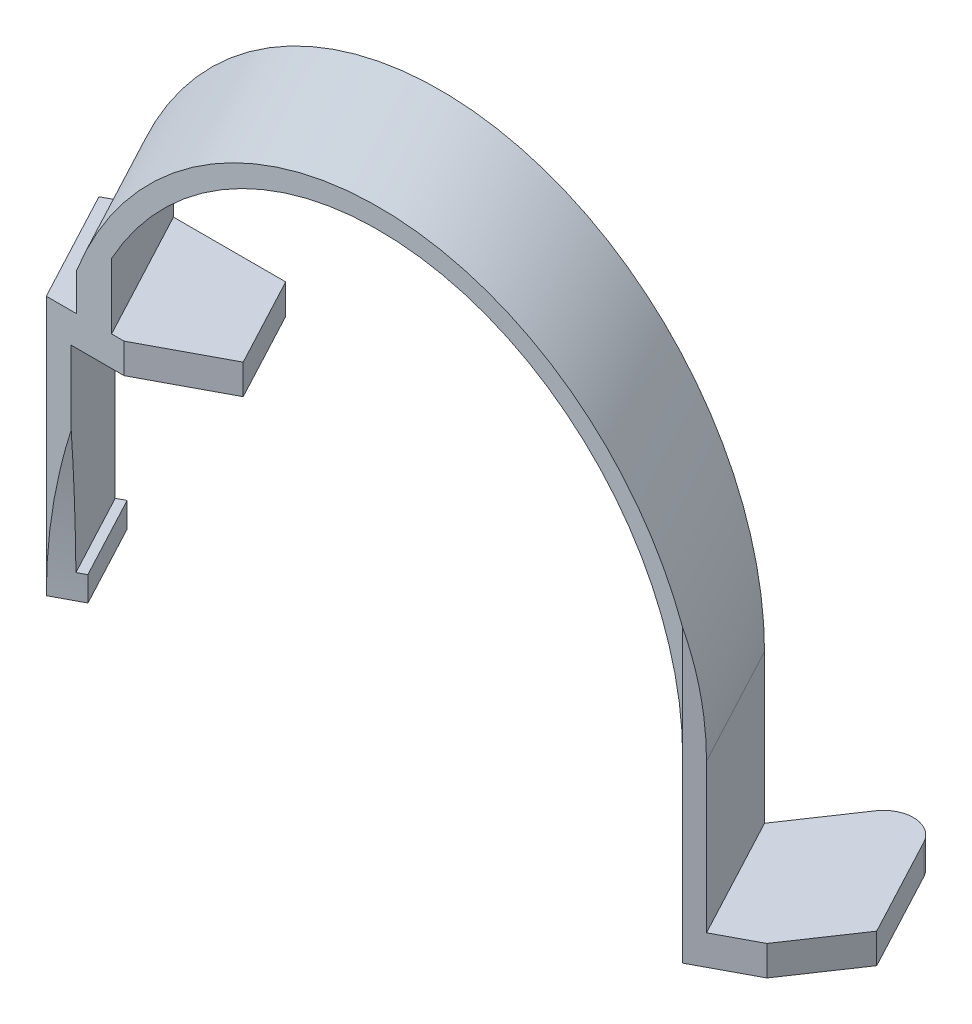
ISO-10303-21;
HEADER;
FILE_DESCRIPTION(('STEP AP214'),'2;1');
FILE_NAME('part.step','',(''),(''),'','','');
FILE_SCHEMA(('AUTOMOTIVE_DESIGN { 1 0 10303 214 1 1 1 1 }'));
ENDSEC;
DATA;
#1=APPLICATION_CONTEXT('core data for automotive mechanical design processes');
#2=APPLICATION_PROTOCOL_DEFINITION('international standard','automotive_design',2000,#1);
#3=PRODUCT_CONTEXT('',#1,'mechanical');
#4=PRODUCT('Part','Part','',(#3));
#5=PRODUCT_RELATED_PRODUCT_CATEGORY('part','',(#4));
#6=PRODUCT_DEFINITION_FORMATION('','',#4);
#7=PRODUCT_DEFINITION_CONTEXT('part definition',#1,'design');
#8=PRODUCT_DEFINITION('design','',#6,#7);
#9=PRODUCT_DEFINITION_SHAPE('','',#8);
#10=(LENGTH_UNIT() NAMED_UNIT(*) SI_UNIT(.MILLI.,.METRE.));
#11=(NAMED_UNIT(*) PLANE_ANGLE_UNIT() SI_UNIT($,.RADIAN.));
#12=(NAMED_UNIT(*) SI_UNIT($,.STERADIAN.) SOLID_ANGLE_UNIT());
#13=UNCERTAINTY_MEASURE_WITH_UNIT(LENGTH_MEASURE(1.E-05),#10,'distance_accuracy_value','');
#14=(GEOMETRIC_REPRESENTATION_CONTEXT(3) GLOBAL_UNCERTAINTY_ASSIGNED_CONTEXT((#13)) GLOBAL_UNIT_ASSIGNED_CONTEXT((#10,
#11,#12)) REPRESENTATION_CONTEXT('',''));
#15=CARTESIAN_POINT('',(0.,0.,0.));
#16=DIRECTION('',(0.,0.,1.));
#17=DIRECTION('',(1.,0.,0.));
#18=AXIS2_PLACEMENT_3D('',#15,#16,#17);
#19=CARTESIAN_POINT('',(-7.04207344178837,0.,-13.2442138928839));
#20=DIRECTION('',(0.,0.,-1.));
#21=DIRECTION('',(-1.,0.,0.));
#22=AXIS2_PLACEMENT_3D('',#19,#20,#21);
#23=PLANE('',#22);
#24=DIRECTION('',(0.,1.,0.));
#25=VECTOR('',#24,1.);
#26=CARTESIAN_POINT('',(25.4579265582116,-34.7865111003914,-13.2442138928839));
#27=LINE('',#26,#25);
#28=CARTESIAN_POINT('',(25.4579265582116,-17.9,-13.2442138928839));
#29=VERTEX_POINT('',#28);
#30=CARTESIAN_POINT('',(25.4579265582116,-14.9,-13.2442138928839));
#31=VERTEX_POINT('',#30);
#32=EDGE_CURVE('E219',#29,#31,#27,.T.);
#33=ORIENTED_EDGE('',*,*,#32,.F.);
#34=DIRECTION('',(1.,0.,0.));
#35=VECTOR('',#34,1.);
#36=CARTESIAN_POINT('',(38.4579265582116,-17.9,-13.2442138928839));
#37=LINE('',#36,#35);
#38=CARTESIAN_POINT('',(23.4579265582116,-17.9,-13.2442138928839));
#39=VERTEX_POINT('',#38);
#40=EDGE_CURVE('E347',#39,#29,#37,.T.);
#41=ORIENTED_EDGE('',*,*,#40,.F.);
#42=DIRECTION('',(0.,-1.,0.));
#43=VECTOR('',#42,1.);
#44=CARTESIAN_POINT('',(23.4579265582116,0.,-13.2442138928839));
#45=LINE('',#44,#43);
#46=CARTESIAN_POINT('',(23.4579265582116,0.,-13.2442138928839));
#47=VERTEX_POINT('',#46);
#48=EDGE_CURVE('E491',#47,#39,#45,.T.);
#49=ORIENTED_EDGE('',*,*,#48,.F.);
#50=CARTESIAN_POINT('',(-7.04207344178837,0.,-13.2442138928839));
#51=DIRECTION('',(0.,0.,-1.));
#52=DIRECTION('',(-1.,0.,0.));
#53=AXIS2_PLACEMENT_3D('',#50,#51,#52);
#54=CIRCLE('',#53,30.5);
#55=CARTESIAN_POINT('',(-33.7920734417884,14.6522182620926,-13.2442138928839));
#56=VERTEX_POINT('',#55);
#57=EDGE_CURVE('E484',#56,#47,#54,.T.);
#58=ORIENTED_EDGE('',*,*,#57,.F.);
#59=DIRECTION('',(0.,1.,0.));
#60=VECTOR('',#59,1.);
#61=CARTESIAN_POINT('',(-33.7920734417884,8.09999999999999,-13.2442138928839));
#62=LINE('',#61,#60);
#63=CARTESIAN_POINT('',(-33.7920734417884,8.09999999999999,-13.2442138928839));
#64=VERTEX_POINT('',#63);
#65=EDGE_CURVE('E476',#64,#56,#62,.T.);
#66=ORIENTED_EDGE('',*,*,#65,.F.);
#67=DIRECTION('',(-1.,0.,0.));
#68=VECTOR('',#67,1.);
#69=CARTESIAN_POINT('',(-22.5420734417884,8.1,-13.2442138928839));
#70=LINE('',#69,#68);
#71=CARTESIAN_POINT('',(-22.5420734417884,8.1,-13.2442138928839));
#72=VERTEX_POINT('',#71);
#73=EDGE_CURVE('E469',#72,#64,#70,.T.);
#74=ORIENTED_EDGE('',*,*,#73,.F.);
#75=DIRECTION('',(0.,1.,0.));
#76=VECTOR('',#75,1.);
#77=CARTESIAN_POINT('',(-22.5420734417884,5.1,-13.2442138928839));
#78=LINE('',#77,#76);
#79=CARTESIAN_POINT('',(-22.5420734417884,5.1,-13.2442138928839));
#80=VERTEX_POINT('',#79);
#81=EDGE_CURVE('E464',#80,#72,#78,.T.);
#82=ORIENTED_EDGE('',*,*,#81,.F.);
#83=DIRECTION('',(1.,0.,0.));
#84=VECTOR('',#83,1.);
#85=CARTESIAN_POINT('',(-33.7920734417884,5.1,-13.2442138928839));
#86=LINE('',#85,#84);
#87=CARTESIAN_POINT('',(-33.7920734417884,5.1,-13.2442138928839));
#88=VERTEX_POINT('',#87);
#89=EDGE_CURVE('E456',#88,#80,#86,.T.);
#90=ORIENTED_EDGE('',*,*,#89,.F.);
#91=DIRECTION('',(1.,0.,0.));
#92=VECTOR('',#91,1.);
#93=CARTESIAN_POINT('',(-37.8420734417884,5.1,-13.2442138928839));
#94=LINE('',#93,#92);
#95=CARTESIAN_POINT('',(-35.2538838395383,5.1,-13.2442138928839));
#96=VERTEX_POINT('',#95);
#97=EDGE_CURVE('E448',#96,#88,#94,.T.);
#98=ORIENTED_EDGE('',*,*,#97,.F.);
#99=CARTESIAN_POINT('',(-53.8485551832628,-2.90000000000001,-13.2442138928839));
#100=DIRECTION('',(0.,0.,-1.));
#101=DIRECTION('',(-1.,0.,0.));
#102=AXIS2_PLACEMENT_3D('',#99,#100,#101);
#103=ELLIPSE('',#102,25.2217813165167,11.8409090909091);
#104=CARTESIAN_POINT('',(-35.5880298672367,5.26788060441782,-13.2442138928839));
#105=VERTEX_POINT('',#104);
#106=EDGE_CURVE('E425',#105,#96,#103,.T.);
#107=ORIENTED_EDGE('',*,*,#106,.F.);
#108=DIRECTION('',(0.,1.,0.));
#109=VECTOR('',#108,1.);
#110=CARTESIAN_POINT('',(-35.5880298672367,0.,-13.2442138928839));
#111=LINE('',#110,#109);
#112=CARTESIAN_POINT('',(-35.5880298672367,15.5363564504811,-13.2442138928839));
#113=VERTEX_POINT('',#112);
#114=EDGE_CURVE('E258',#105,#113,#111,.T.);
#115=ORIENTED_EDGE('',*,*,#114,.T.);
#116=CARTESIAN_POINT('',(-7.04207344178837,0.,-13.2442138928839));
#117=DIRECTION('',(0.,0.,1.));
#118=DIRECTION('',(-1.,0.,0.));
#119=AXIS2_PLACEMENT_3D('',#116,#117,#118);
#120=CIRCLE('',#119,32.5);
#121=CARTESIAN_POINT('',(25.4579265582116,0.,-13.2442138928839));
#122=VERTEX_POINT('',#121);
#123=EDGE_CURVE('E229',#122,#113,#120,.T.);
#124=ORIENTED_EDGE('',*,*,#123,.F.);
#125=DIRECTION('',(0.,1.,0.));
#126=VECTOR('',#125,1.);
#127=CARTESIAN_POINT('',(25.4579265582116,-14.9,-13.2442138928839));
#128=LINE('',#127,#126);
#129=EDGE_CURVE('E224',#31,#122,#128,.T.);
#130=ORIENTED_EDGE('',*,*,#129,.F.);
#131=EDGE_LOOP('',(#33,#41,#49,#58,#66,#74,#82,#90,#98,#107,#115,#124,#130));
#132=FACE_BOUND('',#131,.T.);
#133=ADVANCED_FACE('F33',(#132),#23,.T.);
#134=CARTESIAN_POINT('',(32.5,0.,0.));
#135=CARTESIAN_POINT('',(25.4579265582116,0.,-13.2442138928839));
#136=CARTESIAN_POINT('',(32.5,46.5453658776146,0.));
#137=CARTESIAN_POINT('',(25.4579265582116,46.5453658776146,-13.2442138928839));
#138=CARTESIAN_POINT('',(-13.2326781943357,55.2052290320959,0.));
#139=CARTESIAN_POINT('',(-20.274751636124,55.2052290320959,-13.2442138928839));
#140=CARTESIAN_POINT('',(-30.25,11.8822346383162,0.));
#141=CARTESIAN_POINT('',(-37.2920734417884,11.8822346383162,-13.2442138928839));
#142=(BOUNDED_SURFACE() B_SPLINE_SURFACE(3,1,((#134,#135),(#136,#137),(#138,#139),(#140,#141)),
.UNSPECIFIED.,.F.,.F.,.F.) B_SPLINE_SURFACE_WITH_KNOTS((4,4),(2,2),(0.,1.),(0.,1.),
.UNSPECIFIED.) GEOMETRIC_REPRESENTATION_ITEM() RATIONAL_B_SPLINE_SURFACE(((1.,1.),
(0.457368067922542,0.457368067922542),(0.457368067922542,0.457368067922542),(1.,1.))) REPRESENTATION_ITEM('') SURFACE());
#143=CARTESIAN_POINT('',(-36.9164961915597,11.8822346383162,-12.5378558185968));
#144=CARTESIAN_POINT('',(-36.8687982856735,12.0379949890474,-12.5632172450269));
#145=CARTESIAN_POINT('',(-36.8201339475619,12.1933758630278,-12.5890925325864));
#146=CARTESIAN_POINT('',(-36.720905244315,12.5032509034758,-12.6418533699943));
#147=CARTESIAN_POINT('',(-36.6703420481109,12.6577455500996,-12.668738298311));
#148=CARTESIAN_POINT('',(-36.5673116330772,12.9658464892543,-12.7235205417324));
#149=CARTESIAN_POINT('',(-36.514845197407,13.1194531176933,-12.7514174404239));
#150=CARTESIAN_POINT('',(-36.4080029551091,13.4257757019607,-12.8082264683536));
#151=CARTESIAN_POINT('',(-36.3536275438921,13.5784918346865,-12.8371383873482));
#152=CARTESIAN_POINT('',(-36.242960069378,13.8830318573129,-12.8959813273255));
#153=CARTESIAN_POINT('',(-36.1866679941199,14.0348557416385,-12.925912354668));
#154=CARTESIAN_POINT('',(-36.0721595520628,14.3376059722232,-12.9867975733146));
#155=CARTESIAN_POINT('',(-36.0139428008037,14.4885321319677,-13.0177519690398));
#156=CARTESIAN_POINT('',(-35.8955755034144,14.7894821608153,-13.0806889774619));
#157=CARTESIAN_POINT('',(-35.835424181289,14.9395056384545,-13.1126720027629));
#158=CARTESIAN_POINT('',(-35.7131768580037,15.2386447351217,-13.177672057549));
#159=CARTESIAN_POINT('',(-35.6510796845373,15.3877597396114,-13.2106897103606));
#160=CARTESIAN_POINT('',(-35.5880298672367,15.5363564504811,-13.2442138928839));
#161=B_SPLINE_CURVE_WITH_KNOTS('',3,(#143,#144,#145,#146,#147,#148,#149,#150,#151,#152,#153,
#154,#155,#156,#157,#158,#159,#160),.UNSPECIFIED.,.F.,.F.,(4,2,2,2,2,2,2,2,4),(0.,
0.494583032251077,0.988866437212226,1.48294870785065,1.97692923492772,2.4709128452541,
2.96499573373384,3.45927934315677,3.95386669383938),.UNSPECIFIED.);
#162=CARTESIAN_POINT('',(-36.9164961915597,11.8822346383162,-12.5378558185968));
#163=VERTEX_POINT('',#162);
#164=EDGE_CURVE('E250',#163,#113,#161,.T.);
#165=DIRECTION('',(-0.469471562785892,0.,-0.882947592858926));
#166=VECTOR('',#165,1.);
#167=CARTESIAN_POINT('',(-30.25,11.8822346383162,0.));
#168=LINE('',#167,#166);
#169=CARTESIAN_POINT('',(-30.25,11.8822346383162,0.));
#170=VERTEX_POINT('',#169);
#171=EDGE_CURVE('E357',#170,#163,#168,.T.);
#172=CARTESIAN_POINT('',(0.,0.,0.));
#173=DIRECTION('',(0.,0.,1.));
#174=DIRECTION('',(-1.,0.,0.));
#175=AXIS2_PLACEMENT_3D('',#172,#173,#174);
#176=CIRCLE('',#175,32.5);
#177=CARTESIAN_POINT('',(30.5,11.2249721603218,0.));
#178=VERTEX_POINT('',#177);
#179=EDGE_CURVE('E352',#178,#170,#176,.T.);
#180=CARTESIAN_POINT('',(30.5,11.2249721603217,0.));
#181=CARTESIAN_POINT('',(30.5870300877948,10.9216438047626,-0.0462747185188256));
#182=CARTESIAN_POINT('',(30.6704364276544,10.6169834846295,-0.0906226560825374));
#183=CARTESIAN_POINT('',(30.8297133460518,10.0062889779655,-0.175311695840425));
#184=CARTESIAN_POINT('',(30.9056089310888,9.70026315792595,-0.215666094226057));
#185=CARTESIAN_POINT('',(31.0499792206244,9.08687043789797,-0.292429138823825));
#186=CARTESIAN_POINT('',(31.1184736321463,8.77950948571191,-0.328848263446127));
#187=CARTESIAN_POINT('',(31.2481363209366,8.16347236743959,-0.397791138010515));
#188=CARTESIAN_POINT('',(31.309319207014,7.85480014475877,-0.430322655594131));
#189=CARTESIAN_POINT('',(31.4244337380131,7.23616096360021,-0.491530137447629));
#190=CARTESIAN_POINT('',(31.4783750436956,6.92619631049452,-0.520211238435138));
#191=CARTESIAN_POINT('',(31.5790624388578,6.3049872616726,-0.573747676092342));
#192=CARTESIAN_POINT('',(31.6258133405621,5.9937438662515,-0.59860557146719));
#193=CARTESIAN_POINT('',(31.712154736267,5.37000739693937,-0.644514105906288));
#194=CARTESIAN_POINT('',(31.7517457115576,5.05751440849034,-0.66556500087697));
#195=CARTESIAN_POINT('',(31.8237919419099,4.43125077131639,-0.703872661070926));
#196=CARTESIAN_POINT('',(31.8562421367813,4.11747937601429,-0.721126735743343));
#197=CARTESIAN_POINT('',(31.914007354856,3.48865884379545,-0.751841047015646));
#198=CARTESIAN_POINT('',(31.9393124962721,3.17360854265872,-0.765296029376087));
#199=CARTESIAN_POINT('',(31.9827697650184,2.54222820401616,-0.788402669042736));
#200=CARTESIAN_POINT('',(32.0009071713295,2.22589686698319,-0.798046499044231));
#201=CARTESIAN_POINT('',(32.0299926121239,1.59195057334708,-0.813511502238647));
#202=CARTESIAN_POINT('',(32.0409210206188,1.27433446187131,-0.819322240108433));
#203=CARTESIAN_POINT('',(32.0555335570521,0.63781269376178,-0.827091863550531));
#204=CARTESIAN_POINT('',(32.0591930396647,0.318906311124735,-0.829037644970639));
#205=CARTESIAN_POINT('',(32.0591929034708,0.,-0.829037572555029));
#206=B_SPLINE_CURVE_WITH_KNOTS('',3,(#180,#181,#182,#183,#184,#185,#186,#187,#188,#189,#190,
#191,#192,#193,#194,#195,#196,#197,#198,#199,#200,#201,#202,#203,#204,#205),.UNSPECIFIED.,.F.,
.F.,(4,2,2,2,2,2,2,2,2,2,2,2,4),(0.,0.956792913563713,1.91028477245361,2.86117173935745,
3.81012584023216,4.75780111745014,5.70483937084619,6.65181394068355,7.59945742195184,
8.54840516897329,9.49929185052377,10.4527566859828,11.4094487674815),.UNSPECIFIED.);
#207=CARTESIAN_POINT('',(32.0591929034708,0.,-0.829037572555032));
#208=VERTEX_POINT('',#207);
#209=EDGE_CURVE('E296',#178,#208,#206,.T.);
#210=DIRECTION('',(-0.469471562785892,0.,-0.882947592858926));
#211=VECTOR('',#210,1.);
#212=CARTESIAN_POINT('',(32.5,0.,0.));
#213=LINE('',#212,#211);
#214=EDGE_CURVE('E232',#208,#122,#213,.T.);
#215=ORIENTED_EDGE('',*,*,#164,.F.);
#216=ORIENTED_EDGE('',*,*,#171,.F.);
#217=ORIENTED_EDGE('',*,*,#179,.F.);
#218=ORIENTED_EDGE('',*,*,#209,.T.);
#219=ORIENTED_EDGE('',*,*,#214,.T.);
#220=ORIENTED_EDGE('',*,*,#123,.T.);
#221=EDGE_LOOP('',(#215,#216,#217,#218,#219,#220));
#222=FACE_BOUND('',#221,.T.);
#223=ADVANCED_FACE('F260',(#222),#142,.F.);
#224=CARTESIAN_POINT('',(-30.25,8.09999999999999,0.));
#225=DIRECTION('',(0.882947592858927,0.,-0.469471562785892));
#226=DIRECTION('',(-0.469471562785892,0.,-0.882947592858927));
#227=AXIS2_PLACEMENT_3D('',#224,#225,#226);
#228=PLANE('',#227);
#229=DIRECTION('',(0.,1.,0.));
#230=VECTOR('',#229,1.);
#231=CARTESIAN_POINT('',(-36.9164961915597,8.09999999999999,-12.5378558185968));
#232=LINE('',#231,#230);
#233=CARTESIAN_POINT('',(-36.9164961915597,8.09999999999999,-12.5378558185967));
#234=VERTEX_POINT('',#233);
#235=EDGE_CURVE('E248',#234,#163,#232,.T.);
#236=ORIENTED_EDGE('',*,*,#235,.F.);
#237=DIRECTION('',(-0.469471562785892,0.,-0.882947592858926));
#238=VECTOR('',#237,1.);
#239=CARTESIAN_POINT('',(-30.25,8.09999999999999,0.));
#240=LINE('',#239,#238);
#241=CARTESIAN_POINT('',(-30.25,8.09999999999999,0.));
#242=VERTEX_POINT('',#241);
#243=EDGE_CURVE('E360',#242,#234,#240,.T.);
#244=ORIENTED_EDGE('',*,*,#243,.F.);
#245=DIRECTION('',(0.,-1.,0.));
#246=VECTOR('',#245,1.);
#247=CARTESIAN_POINT('',(-30.25,8.09999999999999,0.));
#248=LINE('',#247,#246);
#249=EDGE_CURVE('E354',#170,#242,#248,.T.);
#250=ORIENTED_EDGE('',*,*,#249,.F.);
#251=ORIENTED_EDGE('',*,*,#171,.T.);
#252=EDGE_LOOP('',(#236,#244,#250,#251));
#253=FACE_BOUND('',#252,.T.);
#254=ADVANCED_FACE('F565',(#253),#228,.F.);
#255=CARTESIAN_POINT('',(-33.3,8.1,0.));
#256=DIRECTION('',(0.,-1.,0.));
#257=DIRECTION('',(1.,0.,0.));
#258=AXIS2_PLACEMENT_3D('',#255,#256,#257);
#259=PLANE('',#258);
#260=DIRECTION('',(0.882947592858927,0.,-0.469471562785891));
#261=VECTOR('',#260,1.);
#262=CARTESIAN_POINT('',(-39.2942653693525,8.1,-11.2735735204503));
#263=LINE('',#262,#261);
#264=CARTESIAN_POINT('',(-39.2942653693525,8.09999999999999,-11.2735735204503));
#265=VERTEX_POINT('',#264);
#266=EDGE_CURVE('E246',#265,#234,#263,.T.);
#267=ORIENTED_EDGE('',*,*,#266,.F.);
#268=DIRECTION('',(-0.469471562785892,0.,-0.882947592858926));
#269=VECTOR('',#268,1.);
#270=CARTESIAN_POINT('',(-33.3,8.1,0.));
#271=LINE('',#270,#269);
#272=CARTESIAN_POINT('',(-33.3,8.1,0.));
#273=VERTEX_POINT('',#272);
#274=EDGE_CURVE('E366',#273,#265,#271,.T.);
#275=ORIENTED_EDGE('',*,*,#274,.F.);
#276=DIRECTION('',(-1.,0.,0.));
#277=VECTOR('',#276,1.);
#278=CARTESIAN_POINT('',(-33.3,8.1,0.));
#279=LINE('',#278,#277);
#280=EDGE_CURVE('E363',#242,#273,#279,.T.);
#281=ORIENTED_EDGE('',*,*,#280,.F.);
#282=ORIENTED_EDGE('',*,*,#243,.T.);
#283=EDGE_LOOP('',(#267,#275,#281,#282));
#284=FACE_BOUND('',#283,.T.);
#285=ADVANCED_FACE('F562',(#284),#259,.F.);
#286=CARTESIAN_POINT('',(-33.3,-17.9,0.));
#287=DIRECTION('',(0.882947592858927,0.,-0.469471562785892));
#288=DIRECTION('',(-0.469471562785892,0.,-0.882947592858927));
#289=AXIS2_PLACEMENT_3D('',#286,#287,#288);
#290=PLANE('',#289);
#291=DIRECTION('',(0.,1.,0.));
#292=VECTOR('',#291,1.);
#293=CARTESIAN_POINT('',(-39.2942653693525,-17.9,-11.2735735204503));
#294=LINE('',#293,#292);
#295=CARTESIAN_POINT('',(-39.2942653693525,5.26788060441782,-11.2735735204503));
#296=VERTEX_POINT('',#295);
#297=EDGE_CURVE('E242',#296,#265,#294,.T.);
#298=ORIENTED_EDGE('',*,*,#297,.F.);
#299=CARTESIAN_POINT('',(-43.3189499421807,-2.90000000000001,-18.8429043112394));
#300=DIRECTION('',(-0.882947592858926,0.,0.469471562785892));
#301=DIRECTION('',(0.469471562785892,0.,0.882947592858926));
#302=AXIS2_PLACEMENT_3D('',#299,#300,#301);
#303=CIRCLE('',#302,11.8409090909091);
#304=CARTESIAN_POINT('',(-37.759979846466,-2.9,-8.3880021321598));
#305=VERTEX_POINT('',#304);
#306=EDGE_CURVE('E391',#305,#296,#303,.T.);
#307=ORIENTED_EDGE('',*,*,#306,.F.);
#308=DIRECTION('',(0.,1.,0.));
#309=VECTOR('',#308,1.);
#310=CARTESIAN_POINT('',(-37.759979846466,-17.9,-8.38800213215979));
#311=LINE('',#310,#309);
#312=CARTESIAN_POINT('',(-37.759979846466,-17.9,-8.38800213215979));
#313=VERTEX_POINT('',#312);
#314=EDGE_CURVE('E396',#313,#305,#311,.T.);
#315=ORIENTED_EDGE('',*,*,#314,.F.);
#316=DIRECTION('',(-0.469471562785892,0.,-0.882947592858926));
#317=VECTOR('',#316,1.);
#318=CARTESIAN_POINT('',(-33.3,-17.9,0.));
#319=LINE('',#318,#317);
#320=CARTESIAN_POINT('',(-33.3,-17.9,0.));
#321=VERTEX_POINT('',#320);
#322=EDGE_CURVE('E372',#321,#313,#319,.T.);
#323=ORIENTED_EDGE('',*,*,#322,.F.);
#324=DIRECTION('',(0.,-1.,0.));
#325=VECTOR('',#324,1.);
#326=CARTESIAN_POINT('',(-33.3,-17.9,0.));
#327=LINE('',#326,#325);
#328=EDGE_CURVE('E369',#273,#321,#327,.T.);
#329=ORIENTED_EDGE('',*,*,#328,.F.);
#330=ORIENTED_EDGE('',*,*,#274,.T.);
#331=EDGE_LOOP('',(#298,#307,#315,#323,#329,#330));
#332=FACE_BOUND('',#331,.T.);
#333=ADVANCED_FACE('F282',(#332),#290,.F.);
#334=CARTESIAN_POINT('',(21.0258385599899,-2.90000000000001,-53.0556352361067));
#335=DIRECTION('',(-0.882947592858927,0.,0.469471562785892));
#336=DIRECTION('',(0.469471562785892,0.,0.882947592858927));
#337=AXIS2_PLACEMENT_3D('',#334,#335,#336);
#338=CYLINDRICAL_SURFACE('',#337,11.8409090909091);
#339=DIRECTION('',(-0.882947592858927,0.,0.469471562785892));
#340=VECTOR('',#339,1.);
#341=CARTESIAN_POINT('',(25.0505231328181,5.26788060441782,-45.4863044453176));
#342=LINE('',#341,#340);
#343=EDGE_CURVE('E321',#105,#296,#342,.T.);
#344=ORIENTED_EDGE('',*,*,#343,.F.);
#345=ORIENTED_EDGE('',*,*,#106,.T.);
#346=DIRECTION('',(-0.882947592858927,0.,0.469471562785892));
#347=VECTOR('',#346,1.);
#348=CARTESIAN_POINT('',(25.1241701029614,5.1,-45.3477946394766));
#349=LINE('',#348,#347);
#350=CARTESIAN_POINT('',(-37.2716272698708,5.1,-12.1713606803031));
#351=VERTEX_POINT('',#350);
#352=EDGE_CURVE('E419',#351,#96,#349,.F.);
#353=ORIENTED_EDGE('',*,*,#352,.F.);
#354=CARTESIAN_POINT('',(-41.3699588128423,-2.90000000000001,-19.8792012769332));
#355=DIRECTION('',(-0.882947592858926,0.,0.469471562785892));
#356=DIRECTION('',(0.469471562785892,0.,0.882947592858927));
#357=AXIS2_PLACEMENT_3D('',#354,#355,#356);
#358=CIRCLE('',#357,11.8409090909091);
#359=CARTESIAN_POINT('',(-35.8109887171276,-2.9,-9.4242990978536));
#360=VERTEX_POINT('',#359);
#361=EDGE_CURVE('E422',#360,#351,#358,.T.);
#362=ORIENTED_EDGE('',*,*,#361,.F.);
#363=DIRECTION('',(-0.882947592858927,0.,0.469471562785892));
#364=VECTOR('',#363,1.);
#365=CARTESIAN_POINT('',(26.5848086557047,-2.9,-42.6007330570271));
#366=LINE('',#365,#364);
#367=EDGE_CURVE('E390',#360,#305,#366,.T.);
#368=ORIENTED_EDGE('',*,*,#367,.T.);
#369=ORIENTED_EDGE('',*,*,#306,.T.);
#370=EDGE_LOOP('',(#344,#345,#353,#362,#368,#369));
#371=FACE_BOUND('',#370,.T.);
#372=ADVANCED_FACE('F278',(#371),#338,.F.);
#373=CARTESIAN_POINT('',(0.,0.,0.));
#374=DIRECTION('',(0.,0.,-1.));
#375=DIRECTION('',(-1.,0.,0.));
#376=AXIS2_PLACEMENT_3D('',#373,#374,#375);
#377=PLANE('',#376);
#378=DIRECTION('',(1.,0.,0.));
#379=VECTOR('',#378,1.);
#380=CARTESIAN_POINT('',(-26.75,5.1,0.));
#381=LINE('',#380,#379);
#382=CARTESIAN_POINT('',(-26.75,5.1,0.));
#383=VERTEX_POINT('',#382);
#384=CARTESIAN_POINT('',(-25.5000000000001,5.1,0.));
#385=VERTEX_POINT('',#384);
#386=EDGE_CURVE('E451',#383,#385,#381,.T.);
#387=ORIENTED_EDGE('',*,*,#386,.T.);
#388=DIRECTION('',(0.,1.,0.));
#389=VECTOR('',#388,1.);
#390=CARTESIAN_POINT('',(-25.5000000000001,0.,0.));
#391=LINE('',#390,#389);
#392=CARTESIAN_POINT('',(-25.5000000000001,8.09999999999999,0.));
#393=VERTEX_POINT('',#392);
#394=EDGE_CURVE('E312',#385,#393,#391,.T.);
#395=ORIENTED_EDGE('',*,*,#394,.T.);
#396=DIRECTION('',(-1.,0.,0.));
#397=VECTOR('',#396,1.);
#398=CARTESIAN_POINT('',(-15.5,8.1,0.));
#399=LINE('',#398,#397);
#400=CARTESIAN_POINT('',(-26.75,8.09999999999999,0.));
#401=VERTEX_POINT('',#400);
#402=EDGE_CURVE('E459',#393,#401,#399,.T.);
#403=ORIENTED_EDGE('',*,*,#402,.T.);
#404=DIRECTION('',(0.,1.,0.));
#405=VECTOR('',#404,1.);
#406=CARTESIAN_POINT('',(-26.75,8.09999999999999,0.));
#407=LINE('',#406,#405);
#408=CARTESIAN_POINT('',(-26.75,14.6522182620926,0.));
#409=VERTEX_POINT('',#408);
#410=EDGE_CURVE('E471',#401,#409,#407,.T.);
#411=ORIENTED_EDGE('',*,*,#410,.T.);
#412=CARTESIAN_POINT('',(0.,0.,0.));
#413=DIRECTION('',(0.,0.,-1.));
#414=DIRECTION('',(-1.,0.,0.));
#415=AXIS2_PLACEMENT_3D('',#412,#413,#414);
#416=CIRCLE('',#415,30.5);
#417=CARTESIAN_POINT('',(30.5,0.,0.));
#418=VERTEX_POINT('',#417);
#419=EDGE_CURVE('E479',#409,#418,#416,.T.);
#420=ORIENTED_EDGE('',*,*,#419,.T.);
#421=DIRECTION('',(0.,-1.,0.));
#422=VECTOR('',#421,1.);
#423=CARTESIAN_POINT('',(30.5,32.5,0.));
#424=LINE('',#423,#422);
#425=EDGE_CURVE('E430',#178,#418,#424,.T.);
#426=ORIENTED_EDGE('',*,*,#425,.F.);
#427=ORIENTED_EDGE('',*,*,#179,.T.);
#428=ORIENTED_EDGE('',*,*,#249,.T.);
#429=ORIENTED_EDGE('',*,*,#280,.T.);
#430=ORIENTED_EDGE('',*,*,#328,.T.);
#431=CARTESIAN_POINT('',(189.704479488069,-17.9,0.));
#432=DIRECTION('',(0.,0.,-1.));
#433=DIRECTION('',(-1.,0.,0.));
#434=AXIS2_PLACEMENT_3D('',#431,#432,#433);
#435=ELLIPSE('',#434,223.004479488069,104.694261493518);
#436=CARTESIAN_POINT('',(-30.8,-2.26742597606738,0.));
#437=VERTEX_POINT('',#436);
#438=EDGE_CURVE('E416',#321,#437,#435,.T.);
#439=ORIENTED_EDGE('',*,*,#438,.T.);
#440=DIRECTION('',(0.,1.,0.));
#441=VECTOR('',#440,1.);
#442=CARTESIAN_POINT('',(-30.8,-15.4161392660939,0.));
#443=LINE('',#442,#441);
#444=CARTESIAN_POINT('',(-30.8,5.1,0.));
#445=VERTEX_POINT('',#444);
#446=EDGE_CURVE('E435',#437,#445,#443,.T.);
#447=ORIENTED_EDGE('',*,*,#446,.T.);
#448=DIRECTION('',(1.,0.,0.));
#449=VECTOR('',#448,1.);
#450=CARTESIAN_POINT('',(-30.8,5.1,0.));
#451=LINE('',#450,#449);
#452=EDGE_CURVE('E445',#445,#383,#451,.T.);
#453=ORIENTED_EDGE('',*,*,#452,.T.);
#454=EDGE_LOOP('',(#387,#395,#403,#411,#420,#426,#427,#428,#429,#430,#439,#447,#453));
#455=FACE_BOUND('',#454,.T.);
#456=ADVANCED_FACE('F281',(#455),#377,.F.);
#457=CARTESIAN_POINT('',(-29.8,-17.9,0.));
#458=DIRECTION('',(-0.882947592858926,0.,0.469471562785892));
#459=DIRECTION('',(0.469471562785892,0.,0.882947592858927));
#460=AXIS2_PLACEMENT_3D('',#457,#458,#459);
#461=PLANE('',#460);
#462=DIRECTION('',(-0.469471562785892,0.,-0.882947592858926));
#463=VECTOR('',#462,1.);
#464=CARTESIAN_POINT('',(-29.8,-15.4161392660939,0.));
#465=LINE('',#464,#463);
#466=CARTESIAN_POINT('',(-30.557577646255,-15.4161392660939,-1.42479632886655));
#467=VERTEX_POINT('',#466);
#468=CARTESIAN_POINT('',(-35.0313922653922,-15.4161392660939,-9.83881788413113));
#469=VERTEX_POINT('',#468);
#470=EDGE_CURVE('E436',#467,#469,#465,.T.);
#471=ORIENTED_EDGE('',*,*,#470,.F.);
#472=CARTESIAN_POINT('',(18.5795661391506,-17.9,90.9887304198736));
#473=DIRECTION('',(-0.882947592858926,0.,0.469471562785892));
#474=DIRECTION('',(0.469471562785892,0.,0.882947592858927));
#475=AXIS2_PLACEMENT_3D('',#472,#473,#474);
#476=CIRCLE('',#475,104.694261493518);
#477=CARTESIAN_POINT('',(-30.5714124189262,-17.9,-1.45081575197132));
#478=VERTEX_POINT('',#477);
#479=EDGE_CURVE('E413',#467,#478,#476,.T.);
#480=ORIENTED_EDGE('',*,*,#479,.T.);
#481=DIRECTION('',(-0.469471562785892,0.,-0.882947592858926));
#482=VECTOR('',#481,1.);
#483=CARTESIAN_POINT('',(-29.8,-17.9,0.));
#484=LINE('',#483,#482);
#485=CARTESIAN_POINT('',(-35.0313922653922,-17.9,-9.83881788413113));
#486=VERTEX_POINT('',#485);
#487=EDGE_CURVE('E374',#478,#486,#484,.T.);
#488=ORIENTED_EDGE('',*,*,#487,.T.);
#489=DIRECTION('',(0.,1.,0.));
#490=VECTOR('',#489,1.);
#491=CARTESIAN_POINT('',(-35.0313922653922,-17.9,-9.83881788413113));
#492=LINE('',#491,#490);
#493=EDGE_CURVE('E404',#486,#469,#492,.T.);
#494=ORIENTED_EDGE('',*,*,#493,.T.);
#495=EDGE_LOOP('',(#471,#480,#488,#494));
#496=FACE_BOUND('',#495,.T.);
#497=ADVANCED_FACE('F293',(#496),#461,.F.);
#498=CARTESIAN_POINT('',(-29.8,-15.4161392660939,0.));
#499=DIRECTION('',(0.,-1.,0.));
#500=DIRECTION('',(0.,0.,-1.));
#501=AXIS2_PLACEMENT_3D('',#498,#499,#500);
#502=PLANE('',#501);
#503=DIRECTION('',(-0.469471562785892,0.,-0.882947592858926));
#504=VECTOR('',#503,1.);
#505=CARTESIAN_POINT('',(-30.8,-15.4161392660939,0.));
#506=LINE('',#505,#504);
#507=CARTESIAN_POINT('',(-31.3371740979903,-15.4161392660939,-1.01027754258902));
#508=VERTEX_POINT('',#507);
#509=CARTESIAN_POINT('',(-35.8109887171275,-15.4161392660939,-9.42429909785361));
#510=VERTEX_POINT('',#509);
#511=EDGE_CURVE('E439',#508,#510,#506,.T.);
#512=ORIENTED_EDGE('',*,*,#511,.F.);
#513=DIRECTION('',(-0.882947592858927,0.,0.469471562785892));
#514=VECTOR('',#513,1.);
#515=CARTESIAN_POINT('',(31.0586232748419,-15.4161392660939,-34.1867115017625));
#516=LINE('',#515,#514);
#517=EDGE_CURVE('E410',#508,#467,#516,.F.);
#518=ORIENTED_EDGE('',*,*,#517,.T.);
#519=ORIENTED_EDGE('',*,*,#470,.T.);
#520=DIRECTION('',(-0.882947592858927,0.,0.469471562785892));
#521=VECTOR('',#520,1.);
#522=CARTESIAN_POINT('',(-35.0313922653922,-15.4161392660939,-9.83881788413113));
#523=LINE('',#522,#521);
#524=EDGE_CURVE('E401',#469,#510,#523,.T.);
#525=ORIENTED_EDGE('',*,*,#524,.T.);
#526=EDGE_LOOP('',(#512,#518,#519,#525));
#527=FACE_BOUND('',#526,.T.);
#528=ADVANCED_FACE('F542',(#527),#502,.F.);
#529=CARTESIAN_POINT('',(-30.8,-15.4161392660939,0.));
#530=DIRECTION('',(-0.882947592858926,0.,0.469471562785892));
#531=DIRECTION('',(0.469471562785892,0.,0.882947592858927));
#532=AXIS2_PLACEMENT_3D('',#529,#530,#531);
#533=PLANE('',#532);
#534=ORIENTED_EDGE('',*,*,#446,.F.);
#535=CARTESIAN_POINT('',(17.7999696874152,-17.9,91.4032492061511));
#536=DIRECTION('',(-0.882947592858926,0.,0.469471562785892));
#537=DIRECTION('',(0.469471562785892,0.,0.882947592858927));
#538=AXIS2_PLACEMENT_3D('',#535,#536,#537);
#539=CIRCLE('',#538,104.694261493518);
#540=EDGE_CURVE('E407',#437,#508,#539,.T.);
#541=ORIENTED_EDGE('',*,*,#540,.T.);
#542=ORIENTED_EDGE('',*,*,#511,.T.);
#543=DIRECTION('',(0.,1.,0.));
#544=VECTOR('',#543,1.);
#545=CARTESIAN_POINT('',(-35.8109887171275,-15.4161392660939,-9.42429909785361));
#546=LINE('',#545,#544);
#547=EDGE_CURVE('E393',#510,#360,#546,.T.);
#548=ORIENTED_EDGE('',*,*,#547,.T.);
#549=ORIENTED_EDGE('',*,*,#361,.T.);
#550=DIRECTION('',(-0.469471562785892,0.,-0.882947592858926));
#551=VECTOR('',#550,1.);
#552=CARTESIAN_POINT('',(-30.8,5.1,0.));
#553=LINE('',#552,#551);
#554=EDGE_CURVE('E443',#445,#351,#553,.T.);
#555=ORIENTED_EDGE('',*,*,#554,.F.);
#556=EDGE_LOOP('',(#534,#541,#542,#548,#549,#555));
#557=FACE_BOUND('',#556,.T.);
#558=ADVANCED_FACE('F539',(#557),#533,.F.);
#559=CARTESIAN_POINT('',(-30.8,5.1,0.));
#560=DIRECTION('',(0.,1.,0.));
#561=DIRECTION('',(0.,0.,1.));
#562=AXIS2_PLACEMENT_3D('',#559,#560,#561);
#563=PLANE('',#562);
#564=ORIENTED_EDGE('',*,*,#554,.T.);
#565=ORIENTED_EDGE('',*,*,#352,.T.);
#566=ORIENTED_EDGE('',*,*,#97,.T.);
#567=DIRECTION('',(-0.469471562785892,0.,-0.882947592858926));
#568=VECTOR('',#567,1.);
#569=CARTESIAN_POINT('',(-26.75,5.1,0.));
#570=LINE('',#569,#568);
#571=EDGE_CURVE('E453',#383,#88,#570,.T.);
#572=ORIENTED_EDGE('',*,*,#571,.F.);
#573=ORIENTED_EDGE('',*,*,#452,.F.);
#574=EDGE_LOOP('',(#564,#565,#566,#572,#573));
#575=FACE_BOUND('',#574,.T.);
#576=ADVANCED_FACE('F532',(#575),#563,.F.);
#577=CARTESIAN_POINT('',(-26.75,5.1,0.));
#578=DIRECTION('',(0.,1.,0.));
#579=DIRECTION('',(0.,0.,1.));
#580=AXIS2_PLACEMENT_3D('',#577,#578,#579);
#581=PLANE('',#580);
#582=DIRECTION('',(-0.469471562785892,0.,-0.882947592858926));
#583=VECTOR('',#582,1.);
#584=CARTESIAN_POINT('',(-15.5,5.1,0.));
#585=LINE('',#584,#583);
#586=CARTESIAN_POINT('',(-17.7040354826463,5.1,-4.14518786277525));
#587=VERTEX_POINT('',#586);
#588=EDGE_CURVE('E462',#587,#80,#585,.T.);
#589=ORIENTED_EDGE('',*,*,#588,.F.);
#590=DIRECTION('',(0.882947592858926,0.,-0.469471562785893));
#591=VECTOR('',#590,1.);
#592=CARTESIAN_POINT('',(-25.5000000000001,5.1,0.));
#593=LINE('',#592,#591);
#594=EDGE_CURVE('E319',#587,#385,#593,.F.);
#595=ORIENTED_EDGE('',*,*,#594,.T.);
#596=ORIENTED_EDGE('',*,*,#386,.F.);
#597=ORIENTED_EDGE('',*,*,#571,.T.);
#598=ORIENTED_EDGE('',*,*,#89,.T.);
#599=EDGE_LOOP('',(#589,#595,#596,#597,#598));
#600=FACE_BOUND('',#599,.T.);
#601=ADVANCED_FACE('F527',(#600),#581,.F.);
#602=CARTESIAN_POINT('',(-15.5,5.1,0.));
#603=DIRECTION('',(-0.882947592858926,0.,0.469471562785892));
#604=DIRECTION('',(0.469471562785892,0.,0.882947592858927));
#605=AXIS2_PLACEMENT_3D('',#602,#603,#604);
#606=PLANE('',#605);
#607=DIRECTION('',(-0.469471562785892,0.,-0.882947592858926));
#608=VECTOR('',#607,1.);
#609=CARTESIAN_POINT('',(-15.5,8.1,0.));
#610=LINE('',#609,#608);
#611=CARTESIAN_POINT('',(-17.7040354826463,8.1,-4.14518786277525));
#612=VERTEX_POINT('',#611);
#613=EDGE_CURVE('E467',#612,#72,#610,.T.);
#614=ORIENTED_EDGE('',*,*,#613,.F.);
#615=DIRECTION('',(0.,-1.,0.));
#616=VECTOR('',#615,1.);
#617=CARTESIAN_POINT('',(-17.7040354826463,5.1,-4.14518786277525));
#618=LINE('',#617,#616);
#619=EDGE_CURVE('E317',#612,#587,#618,.T.);
#620=ORIENTED_EDGE('',*,*,#619,.T.);
#621=ORIENTED_EDGE('',*,*,#588,.T.);
#622=ORIENTED_EDGE('',*,*,#81,.T.);
#623=EDGE_LOOP('',(#614,#620,#621,#622));
#624=FACE_BOUND('',#623,.T.);
#625=ADVANCED_FACE('F523',(#624),#606,.F.);
#626=CARTESIAN_POINT('',(-15.5,8.1,0.));
#627=DIRECTION('',(0.,-1.,0.));
#628=DIRECTION('',(1.,0.,0.));
#629=AXIS2_PLACEMENT_3D('',#626,#627,#628);
#630=PLANE('',#629);
#631=ORIENTED_EDGE('',*,*,#402,.F.);
#632=DIRECTION('',(-0.882947592858926,0.,0.469471562785893));
#633=VECTOR('',#632,1.);
#634=CARTESIAN_POINT('',(-25.5000000000001,8.09999999999999,0.));
#635=LINE('',#634,#633);
#636=EDGE_CURVE('E315',#393,#612,#635,.F.);
#637=ORIENTED_EDGE('',*,*,#636,.T.);
#638=ORIENTED_EDGE('',*,*,#613,.T.);
#639=ORIENTED_EDGE('',*,*,#73,.T.);
#640=DIRECTION('',(-0.469471562785892,0.,-0.882947592858926));
#641=VECTOR('',#640,1.);
#642=CARTESIAN_POINT('',(-26.75,8.09999999999999,0.));
#643=LINE('',#642,#641);
#644=EDGE_CURVE('E473',#401,#64,#643,.T.);
#645=ORIENTED_EDGE('',*,*,#644,.F.);
#646=EDGE_LOOP('',(#631,#637,#638,#639,#645));
#647=FACE_BOUND('',#646,.T.);
#648=ADVANCED_FACE('F519',(#647),#630,.F.);
#649=CARTESIAN_POINT('',(-26.75,8.09999999999999,0.));
#650=DIRECTION('',(-0.882947592858926,0.,0.469471562785892));
#651=DIRECTION('',(0.469471562785892,0.,0.882947592858927));
#652=AXIS2_PLACEMENT_3D('',#649,#650,#651);
#653=PLANE('',#652);
#654=DIRECTION('',(-0.469471562785892,0.,-0.882947592858926));
#655=VECTOR('',#654,1.);
#656=CARTESIAN_POINT('',(-26.75,14.6522182620926,0.));
#657=LINE('',#656,#655);
#658=EDGE_CURVE('E481',#409,#56,#657,.T.);
#659=ORIENTED_EDGE('',*,*,#658,.F.);
#660=ORIENTED_EDGE('',*,*,#410,.F.);
#661=ORIENTED_EDGE('',*,*,#644,.T.);
#662=ORIENTED_EDGE('',*,*,#65,.T.);
#663=EDGE_LOOP('',(#659,#660,#661,#662));
#664=FACE_BOUND('',#663,.T.);
#665=ADVANCED_FACE('F512',(#664),#653,.F.);
#666=CARTESIAN_POINT('',(-26.75,14.6522182620926,0.));
#667=CARTESIAN_POINT('',(-33.7920734417884,14.6522182620926,-13.2442138928839));
#668=CARTESIAN_POINT('',(-7.77166616460646,49.3002436337999,0.));
#669=CARTESIAN_POINT('',(-14.8137396063948,49.3002436337999,-13.2442138928839));
#670=CARTESIAN_POINT('',(30.5,39.5052251901709,0.));
#671=CARTESIAN_POINT('',(23.4579265582116,39.5052251901709,-13.2442138928839));
#672=CARTESIAN_POINT('',(30.5,0.,0.));
#673=CARTESIAN_POINT('',(23.4579265582116,0.,-13.2442138928839));
#674=(BOUNDED_SURFACE() B_SPLINE_SURFACE(3,1,((#666,#667),(#668,#669),(#670,#671),(#672,#673)),
.UNSPECIFIED.,.F.,.F.,.F.) B_SPLINE_SURFACE_WITH_KNOTS((4,4),(2,2),(0.,1.),(0.,1.),
.UNSPECIFIED.) GEOMETRIC_REPRESENTATION_ITEM() RATIONAL_B_SPLINE_SURFACE(((1.,1.),
(0.498628234560155,0.498628234560155),(0.498628234560155,0.498628234560155),(1.,1.))) REPRESENTATION_ITEM('') SURFACE());
#675=DIRECTION('',(-0.469471562785892,0.,-0.882947592858926));
#676=VECTOR('',#675,1.);
#677=CARTESIAN_POINT('',(30.5,0.,0.));
#678=LINE('',#677,#676);
#679=EDGE_CURVE('E488',#418,#47,#678,.T.);
#680=ORIENTED_EDGE('',*,*,#679,.F.);
#681=ORIENTED_EDGE('',*,*,#419,.F.);
#682=ORIENTED_EDGE('',*,*,#658,.T.);
#683=ORIENTED_EDGE('',*,*,#57,.T.);
#684=EDGE_LOOP('',(#680,#681,#682,#683));
#685=FACE_BOUND('',#684,.T.);
#686=ADVANCED_FACE('F508',(#685),#674,.F.);
#687=CARTESIAN_POINT('',(30.5,0.,0.));
#688=DIRECTION('',(0.882947592858926,0.,-0.469471562785892));
#689=DIRECTION('',(-0.469471562785892,0.,-0.882947592858927));
#690=AXIS2_PLACEMENT_3D('',#687,#688,#689);
#691=PLANE('',#690);
#692=DIRECTION('',(-0.469471562785892,0.,-0.882947592858926));
#693=VECTOR('',#692,1.);
#694=CARTESIAN_POINT('',(30.5,-17.9,0.));
#695=LINE('',#694,#693);
#696=CARTESIAN_POINT('',(30.5,-17.9,0.));
#697=VERTEX_POINT('',#696);
#698=EDGE_CURVE('E494',#697,#39,#695,.T.);
#699=ORIENTED_EDGE('',*,*,#698,.F.);
#700=DIRECTION('',(0.,-1.,0.));
#701=VECTOR('',#700,1.);
#702=CARTESIAN_POINT('',(30.5,0.,0.));
#703=LINE('',#702,#701);
#704=EDGE_CURVE('E355',#418,#697,#703,.T.);
#705=ORIENTED_EDGE('',*,*,#704,.F.);
#706=ORIENTED_EDGE('',*,*,#679,.T.);
#707=ORIENTED_EDGE('',*,*,#48,.T.);
#708=EDGE_LOOP('',(#699,#705,#706,#707));
#709=FACE_BOUND('',#708,.T.);
#710=ADVANCED_FACE('F506',(#709),#691,.F.);
#711=CARTESIAN_POINT('',(45.5,-17.9,0.));
#712=DIRECTION('',(0.,1.,0.));
#713=DIRECTION('',(0.,0.,1.));
#714=AXIS2_PLACEMENT_3D('',#711,#712,#713);
#715=PLANE('',#714);
#716=DIRECTION('',(0.559192903470751,0.,-0.829037572555039));
#717=VECTOR('',#716,1.);
#718=CARTESIAN_POINT('',(25.4579265582116,-17.9,-13.2442138928839));
#719=LINE('',#718,#717);
#720=CARTESIAN_POINT('',(29.9354744755642,-17.9,-19.8824516697963));
#721=VERTEX_POINT('',#720);
#722=EDGE_CURVE('E240',#29,#721,#719,.T.);
#723=ORIENTED_EDGE('',*,*,#722,.T.);
#724=CARTESIAN_POINT('',(32.4225871932293,-17.9,-18.2048729593841));
#725=DIRECTION('',(0.,1.,0.));
#726=DIRECTION('',(0.,0.,1.));
#727=AXIS2_PLACEMENT_3D('',#724,#725,#726);
#728=CIRCLE('',#727,3.);
#729=CARTESIAN_POINT('',(35.0714299718061,-17.9,-19.6132876477417));
#730=VERTEX_POINT('',#729);
#731=EDGE_CURVE('E11',#721,#730,#728,.F.);
#732=ORIENTED_EDGE('',*,*,#731,.T.);
#733=DIRECTION('',(-0.469471562785892,0.,-0.882947592858926));
#734=VECTOR('',#733,1.);
#735=CARTESIAN_POINT('',(45.5,-17.9,0.));
#736=LINE('',#735,#734);
#737=CARTESIAN_POINT('',(40.4465895712198,-17.9,-9.50408273366398));
#738=VERTEX_POINT('',#737);
#739=EDGE_CURVE('E342',#738,#730,#736,.T.);
#740=ORIENTED_EDGE('',*,*,#739,.F.);
#741=DIRECTION('',(0.559192903470754,0.,-0.829037572555037));
#742=VECTOR('',#741,1.);
#743=CARTESIAN_POINT('',(40.4465895712198,-17.9,-9.50408273366398));
#744=LINE('',#743,#742);
#745=CARTESIAN_POINT('',(36.0133136260181,-17.9,-2.9314808546615));
#746=VERTEX_POINT('',#745);
#747=EDGE_CURVE('E326',#738,#746,#744,.F.);
#748=ORIENTED_EDGE('',*,*,#747,.T.);
#749=DIRECTION('',(0.88294759285893,0.,-0.469471562785886));
#750=VECTOR('',#749,1.);
#751=CARTESIAN_POINT('',(42.1939467760306,-17.9,-6.21778179416273));
#752=LINE('',#751,#750);
#753=EDGE_CURVE('E427',#697,#746,#752,.T.);
#754=ORIENTED_EDGE('',*,*,#753,.F.);
#755=ORIENTED_EDGE('',*,*,#698,.T.);
#756=ORIENTED_EDGE('',*,*,#40,.T.);
#757=EDGE_LOOP('',(#723,#732,#740,#748,#754,#755,#756));
#758=FACE_BOUND('',#757,.T.);
#759=ADVANCED_FACE('F497',(#758),#715,.F.);
#760=CARTESIAN_POINT('',(45.5,-14.9,0.));
#761=DIRECTION('',(-0.882947592858926,0.,0.469471562785892));
#762=DIRECTION('',(0.469471562785892,0.,0.882947592858927));
#763=AXIS2_PLACEMENT_3D('',#760,#761,#762);
#764=PLANE('',#763);
#765=ORIENTED_EDGE('',*,*,#739,.T.);
#766=DIRECTION('',(0.,1.,0.));
#767=VECTOR('',#766,1.);
#768=CARTESIAN_POINT('',(35.0714299718061,-14.9,-19.6132876477417));
#769=LINE('',#768,#767);
#770=CARTESIAN_POINT('',(35.0714299718061,-14.9,-19.6132876477417));
#771=VERTEX_POINT('',#770);
#772=EDGE_CURVE('E332',#730,#771,#769,.T.);
#773=ORIENTED_EDGE('',*,*,#772,.T.);
#774=DIRECTION('',(-0.469471562785892,0.,-0.882947592858926));
#775=VECTOR('',#774,1.);
#776=CARTESIAN_POINT('',(45.5,-14.9,0.));
#777=LINE('',#776,#775);
#778=CARTESIAN_POINT('',(40.4465895712198,-14.9,-9.50408273366398));
#779=VERTEX_POINT('',#778);
#780=EDGE_CURVE('E237',#779,#771,#777,.T.);
#781=ORIENTED_EDGE('',*,*,#780,.F.);
#782=DIRECTION('',(0.,-1.,0.));
#783=VECTOR('',#782,1.);
#784=CARTESIAN_POINT('',(40.4465895712198,-14.9,-9.50408273366398));
#785=LINE('',#784,#783);
#786=EDGE_CURVE('E323',#779,#738,#785,.T.);
#787=ORIENTED_EDGE('',*,*,#786,.T.);
#788=EDGE_LOOP('',(#765,#773,#781,#787));
#789=FACE_BOUND('',#788,.T.);
#790=ADVANCED_FACE('F339',(#789),#764,.F.);
#791=CARTESIAN_POINT('',(32.5,-14.9,0.));
#792=DIRECTION('',(0.,-1.,0.));
#793=DIRECTION('',(0.,0.,-1.));
#794=AXIS2_PLACEMENT_3D('',#791,#792,#793);
#795=PLANE('',#794);
#796=ORIENTED_EDGE('',*,*,#780,.T.);
#797=CARTESIAN_POINT('',(32.4225871932293,-14.9,-18.2048729593841));
#798=DIRECTION('',(0.,-1.,0.));
#799=DIRECTION('',(0.,0.,-1.));
#800=AXIS2_PLACEMENT_3D('',#797,#798,#799);
#801=CIRCLE('',#800,3.);
#802=CARTESIAN_POINT('',(29.9354744755642,-14.9,-19.8824516697963));
#803=VERTEX_POINT('',#802);
#804=EDGE_CURVE('E55',#771,#803,#801,.F.);
#805=ORIENTED_EDGE('',*,*,#804,.T.);
#806=DIRECTION('',(-0.559192903470751,0.,0.829037572555039));
#807=VECTOR('',#806,1.);
#808=CARTESIAN_POINT('',(25.4579265582116,-14.9,-13.2442138928839));
#809=LINE('',#808,#807);
#810=EDGE_CURVE('E212',#803,#31,#809,.T.);
#811=ORIENTED_EDGE('',*,*,#810,.T.);
#812=DIRECTION('',(-0.469471562785892,0.,-0.882947592858926));
#813=VECTOR('',#812,1.);
#814=CARTESIAN_POINT('',(32.5,-14.9,0.));
#815=LINE('',#814,#813);
#816=CARTESIAN_POINT('',(32.0591929034708,-14.9,-0.829037572555032));
#817=VERTEX_POINT('',#816);
#818=EDGE_CURVE('E217',#817,#31,#815,.T.);
#819=ORIENTED_EDGE('',*,*,#818,.F.);
#820=DIRECTION('',(0.88294759285893,0.,-0.469471562785886));
#821=VECTOR('',#820,1.);
#822=CARTESIAN_POINT('',(32.0591929034708,-14.9,-0.829037572555035));
#823=LINE('',#822,#821);
#824=CARTESIAN_POINT('',(36.0133136260181,-14.9,-2.9314808546615));
#825=VERTEX_POINT('',#824);
#826=EDGE_CURVE('E433',#817,#825,#823,.T.);
#827=ORIENTED_EDGE('',*,*,#826,.T.);
#828=DIRECTION('',(-0.559192903470754,0.,0.829037572555037));
#829=VECTOR('',#828,1.);
#830=CARTESIAN_POINT('',(40.4465895712198,-14.9,-9.50408273366398));
#831=LINE('',#830,#829);
#832=EDGE_CURVE('E330',#825,#779,#831,.F.);
#833=ORIENTED_EDGE('',*,*,#832,.T.);
#834=EDGE_LOOP('',(#796,#805,#811,#819,#827,#833));
#835=FACE_BOUND('',#834,.T.);
#836=ADVANCED_FACE('F214',(#835),#795,.F.);
#837=CARTESIAN_POINT('',(32.5,-14.9,0.));
#838=DIRECTION('',(-0.882947592858926,0.,0.469471562785892));
#839=DIRECTION('',(0.469471562785892,0.,0.882947592858927));
#840=AXIS2_PLACEMENT_3D('',#837,#838,#839);
#841=PLANE('',#840);
#842=ORIENTED_EDGE('',*,*,#214,.F.);
#843=DIRECTION('',(0.,-1.,0.));
#844=VECTOR('',#843,1.);
#845=CARTESIAN_POINT('',(32.0591929034708,-14.9,-0.829037572555032));
#846=LINE('',#845,#844);
#847=EDGE_CURVE('E236',#208,#817,#846,.T.);
#848=ORIENTED_EDGE('',*,*,#847,.T.);
#849=ORIENTED_EDGE('',*,*,#818,.T.);
#850=ORIENTED_EDGE('',*,*,#129,.T.);
#851=EDGE_LOOP('',(#842,#848,#849,#850));
#852=FACE_BOUND('',#851,.T.);
#853=ADVANCED_FACE('F235',(#852),#841,.F.);
#854=CARTESIAN_POINT('',(-33.3,-17.9,0.));
#855=DIRECTION('',(0.,1.,0.));
#856=DIRECTION('',(0.,0.,1.));
#857=AXIS2_PLACEMENT_3D('',#854,#855,#856);
#858=PLANE('',#857);
#859=DIRECTION('',(-0.469471562785892,0.,-0.882947592858926));
#860=VECTOR('',#859,1.);
#861=CARTESIAN_POINT('',(-30.8,-17.9,0.));
#862=LINE('',#861,#860);
#863=CARTESIAN_POINT('',(-31.3510088706616,-17.9,-1.03629696569381));
#864=VERTEX_POINT('',#863);
#865=CARTESIAN_POINT('',(-35.8109887171276,-17.9,-9.4242990978536));
#866=VERTEX_POINT('',#865);
#867=EDGE_CURVE('E305',#864,#866,#862,.T.);
#868=ORIENTED_EDGE('',*,*,#867,.F.);
#869=DIRECTION('',(-0.882947592858927,0.,0.469471562785892));
#870=VECTOR('',#869,1.);
#871=CARTESIAN_POINT('',(31.0447885021707,-17.9,-34.2127309248673));
#872=LINE('',#871,#870);
#873=EDGE_CURVE('E386',#864,#321,#872,.T.);
#874=ORIENTED_EDGE('',*,*,#873,.T.);
#875=ORIENTED_EDGE('',*,*,#322,.T.);
#876=DIRECTION('',(-0.882947592858927,0.,0.469471562785892));
#877=VECTOR('',#876,1.);
#878=CARTESIAN_POINT('',(26.5848086557047,-17.9,-42.6007330570271));
#879=LINE('',#878,#877);
#880=EDGE_CURVE('E387',#866,#313,#879,.T.);
#881=ORIENTED_EDGE('',*,*,#880,.F.);
#882=EDGE_LOOP('',(#868,#874,#875,#881));
#883=FACE_BOUND('',#882,.T.);
#884=ADVANCED_FACE('F385',(#883),#858,.F.);
#885=CARTESIAN_POINT('',(-30.8,-17.9,0.));
#886=DIRECTION('',(0.,1.,0.));
#887=DIRECTION('',(0.,0.,1.));
#888=AXIS2_PLACEMENT_3D('',#885,#886,#887);
#889=PLANE('',#888);
#890=ORIENTED_EDGE('',*,*,#487,.F.);
#891=DIRECTION('',(-0.882947592858927,0.,0.469471562785892));
#892=VECTOR('',#891,1.);
#893=CARTESIAN_POINT('',(31.0447885021707,-17.9,-34.2127309248673));
#894=LINE('',#893,#892);
#895=EDGE_CURVE('E309',#478,#864,#894,.T.);
#896=ORIENTED_EDGE('',*,*,#895,.T.);
#897=ORIENTED_EDGE('',*,*,#867,.T.);
#898=DIRECTION('',(0.882947592858927,0.,-0.469471562785892));
#899=VECTOR('',#898,1.);
#900=CARTESIAN_POINT('',(-35.8109887171275,-17.9,-9.42429909785361));
#901=LINE('',#900,#899);
#902=EDGE_CURVE('E304',#866,#486,#901,.T.);
#903=ORIENTED_EDGE('',*,*,#902,.T.);
#904=EDGE_LOOP('',(#890,#896,#897,#903));
#905=FACE_BOUND('',#904,.T.);
#906=ADVANCED_FACE('F284',(#905),#889,.F.);
#907=CARTESIAN_POINT('',(42.1939467760306,32.5000000000001,-6.21778179416271));
#908=DIRECTION('',(-0.469471562785886,0.,-0.88294759285893));
#909=DIRECTION('',(-0.88294759285893,0.,0.469471562785886));
#910=AXIS2_PLACEMENT_3D('',#907,#908,#909);
#911=PLANE('',#910);
#912=ORIENTED_EDGE('',*,*,#753,.T.);
#913=DIRECTION('',(0.,1.,0.));
#914=VECTOR('',#913,1.);
#915=CARTESIAN_POINT('',(36.0133136260181,32.5000000000001,-2.9314808546615));
#916=LINE('',#915,#914);
#917=EDGE_CURVE('E328',#746,#825,#916,.T.);
#918=ORIENTED_EDGE('',*,*,#917,.T.);
#919=ORIENTED_EDGE('',*,*,#826,.F.);
#920=ORIENTED_EDGE('',*,*,#847,.F.);
#921=ORIENTED_EDGE('',*,*,#209,.F.);
#922=ORIENTED_EDGE('',*,*,#425,.T.);
#923=ORIENTED_EDGE('',*,*,#704,.T.);
#924=EDGE_LOOP('',(#912,#918,#919,#920,#921,#922,#923));
#925=FACE_BOUND('',#924,.T.);
#926=ADVANCED_FACE('F287',(#925),#911,.F.);
#927=CARTESIAN_POINT('',(26.5848086557047,-17.9,-42.6007330570271));
#928=DIRECTION('',(0.469471562785892,0.,0.882947592858927));
#929=DIRECTION('',(0.882947592858927,0.,-0.469471562785892));
#930=AXIS2_PLACEMENT_3D('',#927,#928,#929);
#931=PLANE('',#930);
#932=ORIENTED_EDGE('',*,*,#902,.F.);
#933=ORIENTED_EDGE('',*,*,#880,.T.);
#934=ORIENTED_EDGE('',*,*,#314,.T.);
#935=ORIENTED_EDGE('',*,*,#367,.F.);
#936=ORIENTED_EDGE('',*,*,#547,.F.);
#937=ORIENTED_EDGE('',*,*,#524,.F.);
#938=ORIENTED_EDGE('',*,*,#493,.F.);
#939=EDGE_LOOP('',(#932,#933,#934,#935,#936,#937,#938));
#940=FACE_BOUND('',#939,.T.);
#941=ADVANCED_FACE('F276',(#940),#931,.F.);
#942=CARTESIAN_POINT('',(80.1957670602475,-17.9,58.2268152469776));
#943=DIRECTION('',(-0.882947592858927,0.,0.469471562785892));
#944=DIRECTION('',(0.469471562785892,0.,0.882947592858927));
#945=AXIS2_PLACEMENT_3D('',#942,#943,#944);
#946=CYLINDRICAL_SURFACE('',#945,104.694261493518);
#947=ORIENTED_EDGE('',*,*,#873,.F.);
#948=ORIENTED_EDGE('',*,*,#895,.F.);
#949=ORIENTED_EDGE('',*,*,#479,.F.);
#950=ORIENTED_EDGE('',*,*,#517,.F.);
#951=ORIENTED_EDGE('',*,*,#540,.F.);
#952=ORIENTED_EDGE('',*,*,#438,.F.);
#953=EDGE_LOOP('',(#947,#948,#949,#950,#951,#952));
#954=FACE_BOUND('',#953,.T.);
#955=ADVANCED_FACE('F273',(#954),#946,.F.);
#956=CARTESIAN_POINT('',(-25.5000000000001,0.,0.));
#957=DIRECTION('',(-0.469471562785893,0.,-0.882947592858926));
#958=DIRECTION('',(0.,1.,0.));
#959=AXIS2_PLACEMENT_3D('',#956,#957,#958);
#960=PLANE('',#959);
#961=ORIENTED_EDGE('',*,*,#594,.F.);
#962=ORIENTED_EDGE('',*,*,#619,.F.);
#963=ORIENTED_EDGE('',*,*,#636,.F.);
#964=ORIENTED_EDGE('',*,*,#394,.F.);
#965=EDGE_LOOP('',(#961,#962,#963,#964));
#966=FACE_BOUND('',#965,.T.);
#967=ADVANCED_FACE('F271',(#966),#960,.F.);
#968=CARTESIAN_POINT('',(-32.9305362757195,17.7241131459027,-14.6572283000736));
#969=DIRECTION('',(-0.469471562785891,0.,-0.882947592858927));
#970=DIRECTION('',(-0.882947592858927,0.,0.469471562785891));
#971=AXIS2_PLACEMENT_3D('',#968,#969,#970);
#972=PLANE('',#971);
#973=ORIENTED_EDGE('',*,*,#343,.T.);
#974=ORIENTED_EDGE('',*,*,#297,.T.);
#975=ORIENTED_EDGE('',*,*,#266,.T.);
#976=ORIENTED_EDGE('',*,*,#235,.T.);
#977=ORIENTED_EDGE('',*,*,#164,.T.);
#978=ORIENTED_EDGE('',*,*,#114,.F.);
#979=EDGE_LOOP('',(#973,#974,#975,#976,#977,#978));
#980=FACE_BOUND('',#979,.T.);
#981=ADVANCED_FACE('F266',(#980),#972,.T.);
#982=CARTESIAN_POINT('',(25.4579265582116,-34.7865111003914,-13.2442138928839));
#983=DIRECTION('',(-0.829037572555039,0.,-0.559192903470751));
#984=DIRECTION('',(-0.559192903470751,0.,0.829037572555039));
#985=AXIS2_PLACEMENT_3D('',#982,#983,#984);
#986=PLANE('',#985);
#987=ORIENTED_EDGE('',*,*,#810,.F.);
#988=DIRECTION('',(0.,1.,0.));
#989=VECTOR('',#988,1.);
#990=CARTESIAN_POINT('',(29.9354744755642,-17.9,-19.8824516697963));
#991=LINE('',#990,#989);
#992=EDGE_CURVE('E41',#803,#721,#991,.F.);
#993=ORIENTED_EDGE('',*,*,#992,.T.);
#994=ORIENTED_EDGE('',*,*,#722,.F.);
#995=ORIENTED_EDGE('',*,*,#32,.T.);
#996=EDGE_LOOP('',(#987,#993,#994,#995));
#997=FACE_BOUND('',#996,.T.);
#998=ADVANCED_FACE('F239',(#997),#986,.T.);
#999=CARTESIAN_POINT('',(40.4465895712198,-14.9,-9.50408273366398));
#1000=DIRECTION('',(-0.829037572555037,0.,-0.559192903470754));
#1001=DIRECTION('',(0.,-1.,0.));
#1002=AXIS2_PLACEMENT_3D('',#999,#1000,#1001);
#1003=PLANE('',#1002);
#1004=ORIENTED_EDGE('',*,*,#832,.F.);
#1005=ORIENTED_EDGE('',*,*,#917,.F.);
#1006=ORIENTED_EDGE('',*,*,#747,.F.);
#1007=ORIENTED_EDGE('',*,*,#786,.F.);
#1008=EDGE_LOOP('',(#1004,#1005,#1006,#1007));
#1009=FACE_BOUND('',#1008,.T.);
#1010=ADVANCED_FACE('F582',(#1009),#1003,.F.);
#1011=CARTESIAN_POINT('',(32.4225871932293,-14.9,-18.2048729593841));
#1012=DIRECTION('',(0.,-1.,0.));
#1013=DIRECTION('',(0.,0.,-1.));
#1014=AXIS2_PLACEMENT_3D('',#1011,#1012,#1013);
#1015=CYLINDRICAL_SURFACE('',#1014,3.);
#1016=ORIENTED_EDGE('',*,*,#731,.F.);
#1017=ORIENTED_EDGE('',*,*,#992,.F.);
#1018=ORIENTED_EDGE('',*,*,#804,.F.);
#1019=ORIENTED_EDGE('',*,*,#772,.F.);
#1020=EDGE_LOOP('',(#1016,#1017,#1018,#1019));
#1021=FACE_BOUND('',#1020,.T.);
#1022=ADVANCED_FACE('F35',(#1021),#1015,.T.);
#1023=CLOSED_SHELL('',(#133,#223,#254,#285,#333,#372,#456,#497,#528,#558,#576,#601,#625,#648,
#665,#686,#710,#759,#790,#836,#853,#884,#906,#926,#941,#955,#967,#981,#998,#1010,#1022));
#1024=MANIFOLD_SOLID_BREP('B2',#1023);
#1025=ADVANCED_BREP_SHAPE_REPRESENTATION('',(#18,#1024),#14);
#1026=SHAPE_DEFINITION_REPRESENTATION(#9,#1025);
ENDSEC;
END-ISO-10303-21;
